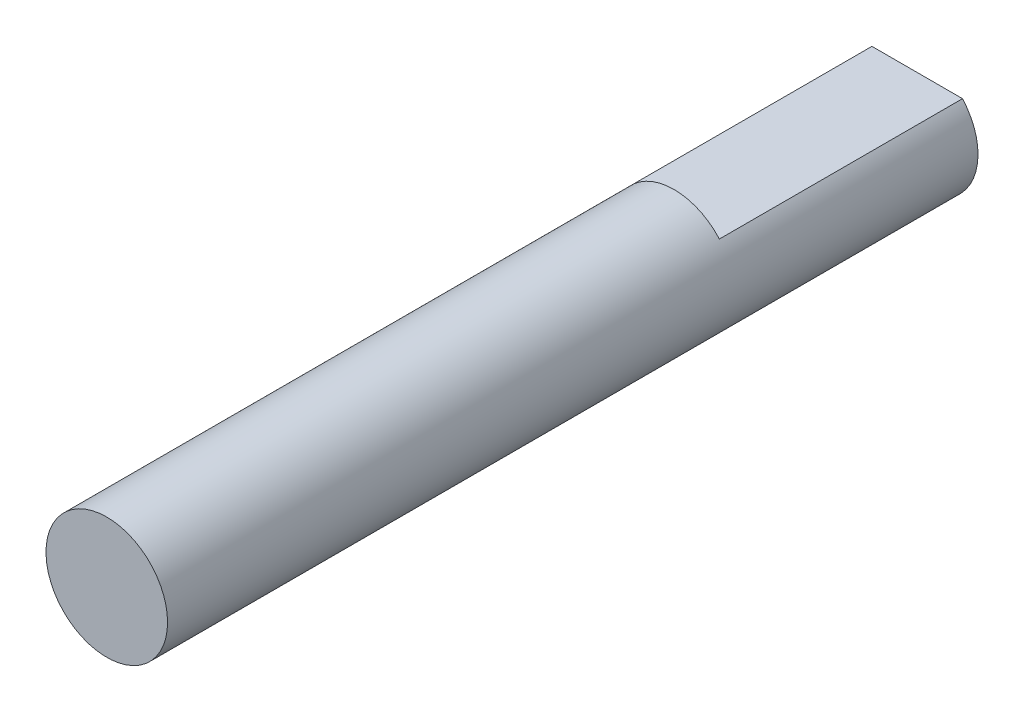
ISO-10303-21;
HEADER;
FILE_DESCRIPTION(('STEP AP214'),'2;1');
FILE_NAME('part.step','',(''),(''),'','','');
FILE_SCHEMA(('AUTOMOTIVE_DESIGN { 1 0 10303 214 1 1 1 1 }'));
ENDSEC;
DATA;
#1=APPLICATION_CONTEXT('core data for automotive mechanical design processes');
#2=APPLICATION_PROTOCOL_DEFINITION('international standard','automotive_design',2000,#1);
#3=PRODUCT_CONTEXT('',#1,'mechanical');
#4=PRODUCT('Part','Part','',(#3));
#5=PRODUCT_RELATED_PRODUCT_CATEGORY('part','',(#4));
#6=PRODUCT_DEFINITION_FORMATION('','',#4);
#7=PRODUCT_DEFINITION_CONTEXT('part definition',#1,'design');
#8=PRODUCT_DEFINITION('design','',#6,#7);
#9=PRODUCT_DEFINITION_SHAPE('','',#8);
#10=(LENGTH_UNIT() NAMED_UNIT(*) SI_UNIT(.MILLI.,.METRE.));
#11=(NAMED_UNIT(*) PLANE_ANGLE_UNIT() SI_UNIT($,.RADIAN.));
#12=(NAMED_UNIT(*) SI_UNIT($,.STERADIAN.) SOLID_ANGLE_UNIT());
#13=UNCERTAINTY_MEASURE_WITH_UNIT(LENGTH_MEASURE(1.E-05),#10,'distance_accuracy_value','');
#14=(GEOMETRIC_REPRESENTATION_CONTEXT(3) GLOBAL_UNCERTAINTY_ASSIGNED_CONTEXT((#13)) GLOBAL_UNIT_ASSIGNED_CONTEXT((#10,
#11,#12)) REPRESENTATION_CONTEXT('',''));
#15=CARTESIAN_POINT('',(0.,0.,0.));
#16=DIRECTION('',(0.,0.,1.));
#17=DIRECTION('',(1.,0.,0.));
#18=AXIS2_PLACEMENT_3D('',#15,#16,#17);
#19=CARTESIAN_POINT('',(2.23606797749979,2.,40.));
#20=DIRECTION('',(0.,-1.,0.));
#21=DIRECTION('',(0.,0.,-1.));
#22=AXIS2_PLACEMENT_3D('',#19,#20,#21);
#23=PLANE('',#22);
#24=DIRECTION('',(1.,0.,0.));
#25=VECTOR('',#24,1.);
#26=CARTESIAN_POINT('',(-2.23606797749979,2.,12.));
#27=LINE('',#26,#25);
#28=CARTESIAN_POINT('',(-2.23606797749979,2.,12.));
#29=VERTEX_POINT('',#28);
#30=CARTESIAN_POINT('',(2.23606797749979,2.,12.));
#31=VERTEX_POINT('',#30);
#32=EDGE_CURVE('E74',#29,#31,#27,.T.);
#33=ORIENTED_EDGE('',*,*,#32,.T.);
#34=DIRECTION('',(0.,0.,-1.));
#35=VECTOR('',#34,1.);
#36=CARTESIAN_POINT('',(2.23606797749979,2.,40.));
#37=LINE('',#36,#35);
#38=CARTESIAN_POINT('',(2.23606797749979,2.,0.));
#39=VERTEX_POINT('',#38);
#40=EDGE_CURVE('E11',#31,#39,#37,.T.);
#41=ORIENTED_EDGE('',*,*,#40,.T.);
#42=DIRECTION('',(-1.,0.,0.));
#43=VECTOR('',#42,1.);
#44=CARTESIAN_POINT('',(2.23606797749979,2.,0.));
#45=LINE('',#44,#43);
#46=CARTESIAN_POINT('',(-2.23606797749979,2.,0.));
#47=VERTEX_POINT('',#46);
#48=EDGE_CURVE('E80',#39,#47,#45,.T.);
#49=ORIENTED_EDGE('',*,*,#48,.T.);
#50=DIRECTION('',(0.,0.,-1.));
#51=VECTOR('',#50,1.);
#52=CARTESIAN_POINT('',(-2.23606797749979,2.,40.));
#53=LINE('',#52,#51);
#54=EDGE_CURVE('E52',#29,#47,#53,.T.);
#55=ORIENTED_EDGE('',*,*,#54,.F.);
#56=EDGE_LOOP('',(#33,#41,#49,#55));
#57=FACE_BOUND('',#56,.T.);
#58=ADVANCED_FACE('F43',(#57),#23,.F.);
#59=CARTESIAN_POINT('',(0.,0.,40.));
#60=DIRECTION('',(0.,0.,-1.));
#61=DIRECTION('',(-1.,0.,0.));
#62=AXIS2_PLACEMENT_3D('',#59,#60,#61);
#63=CYLINDRICAL_SURFACE('',#62,3.);
#64=ORIENTED_EDGE('',*,*,#40,.F.);
#65=CARTESIAN_POINT('',(0.,0.,12.));
#66=DIRECTION('',(0.,0.,1.));
#67=DIRECTION('',(1.,0.,0.));
#68=AXIS2_PLACEMENT_3D('',#65,#66,#67);
#69=CIRCLE('',#68,3.);
#70=EDGE_CURVE('E69',#31,#29,#69,.T.);
#71=ORIENTED_EDGE('',*,*,#70,.T.);
#72=ORIENTED_EDGE('',*,*,#54,.T.);
#73=CARTESIAN_POINT('',(0.,0.,0.));
#74=DIRECTION('',(0.,0.,1.));
#75=DIRECTION('',(1.,0.,0.));
#76=AXIS2_PLACEMENT_3D('',#73,#74,#75);
#77=CIRCLE('',#76,3.);
#78=EDGE_CURVE('E78',#47,#39,#77,.T.);
#79=ORIENTED_EDGE('',*,*,#78,.T.);
#80=EDGE_LOOP('',(#64,#71,#72,#79));
#81=FACE_BOUND('',#80,.T.);
#82=CARTESIAN_POINT('',(0.,0.,40.));
#83=DIRECTION('',(0.,0.,1.));
#84=DIRECTION('',(1.,0.,0.));
#85=AXIS2_PLACEMENT_3D('',#82,#83,#84);
#86=CIRCLE('',#85,3.);
#87=CARTESIAN_POINT('',(3.,0.,40.));
#88=VERTEX_POINT('',#87);
#89=EDGE_CURVE('E83',#88,#88,#86,.T.);
#90=ORIENTED_EDGE('',*,*,#89,.F.);
#91=EDGE_LOOP('',(#90));
#92=FACE_BOUND('',#91,.T.);
#93=ADVANCED_FACE('F45',(#81,#92),#63,.T.);
#94=CARTESIAN_POINT('',(0.,0.,40.));
#95=DIRECTION('',(0.,0.,1.));
#96=DIRECTION('',(1.,0.,0.));
#97=AXIS2_PLACEMENT_3D('',#94,#95,#96);
#98=PLANE('',#97);
#99=ORIENTED_EDGE('',*,*,#89,.T.);
#100=EDGE_LOOP('',(#99));
#101=FACE_BOUND('',#100,.T.);
#102=ADVANCED_FACE('F94',(#101),#98,.T.);
#103=CARTESIAN_POINT('',(0.,0.,0.));
#104=DIRECTION('',(0.,0.,1.));
#105=DIRECTION('',(1.,0.,0.));
#106=AXIS2_PLACEMENT_3D('',#103,#104,#105);
#107=PLANE('',#106);
#108=ORIENTED_EDGE('',*,*,#78,.F.);
#109=ORIENTED_EDGE('',*,*,#48,.F.);
#110=EDGE_LOOP('',(#108,#109));
#111=FACE_BOUND('',#110,.T.);
#112=ADVANCED_FACE('F92',(#111),#107,.F.);
#113=CARTESIAN_POINT('',(0.,0.,12.));
#114=DIRECTION('',(0.,0.,1.));
#115=DIRECTION('',(1.,0.,0.));
#116=AXIS2_PLACEMENT_3D('',#113,#114,#115);
#117=PLANE('',#116);
#118=ORIENTED_EDGE('',*,*,#70,.F.);
#119=ORIENTED_EDGE('',*,*,#32,.F.);
#120=EDGE_LOOP('',(#118,#119));
#121=FACE_BOUND('',#120,.T.);
#122=ADVANCED_FACE('F76',(#121),#117,.F.);
#123=CLOSED_SHELL('',(#58,#93,#102,#112,#122));
#124=MANIFOLD_SOLID_BREP('B2',#123);
#125=ADVANCED_BREP_SHAPE_REPRESENTATION('',(#18,#124),#14);
#126=SHAPE_DEFINITION_REPRESENTATION(#9,#125);
ENDSEC;
END-ISO-10303-21;
